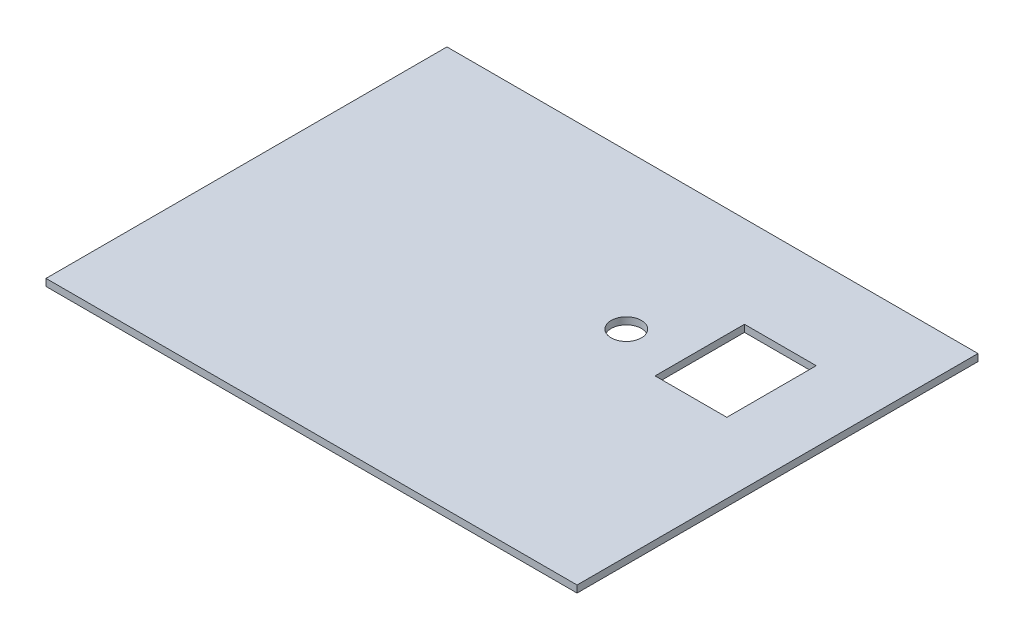
ISO-10303-21;
HEADER;
FILE_DESCRIPTION(('STEP AP214'),'2;1');
FILE_NAME('part.step','',(''),(''),'','','');
FILE_SCHEMA(('AUTOMOTIVE_DESIGN { 1 0 10303 214 1 1 1 1 }'));
ENDSEC;
DATA;
#1=APPLICATION_CONTEXT('core data for automotive mechanical design processes');
#2=APPLICATION_PROTOCOL_DEFINITION('international standard','automotive_design',2000,#1);
#3=PRODUCT_CONTEXT('',#1,'mechanical');
#4=PRODUCT('Part','Part','',(#3));
#5=PRODUCT_RELATED_PRODUCT_CATEGORY('part','',(#4));
#6=PRODUCT_DEFINITION_FORMATION('','',#4);
#7=PRODUCT_DEFINITION_CONTEXT('part definition',#1,'design');
#8=PRODUCT_DEFINITION('design','',#6,#7);
#9=PRODUCT_DEFINITION_SHAPE('','',#8);
#10=(LENGTH_UNIT() NAMED_UNIT(*) SI_UNIT(.MILLI.,.METRE.));
#11=(NAMED_UNIT(*) PLANE_ANGLE_UNIT() SI_UNIT($,.RADIAN.));
#12=(NAMED_UNIT(*) SI_UNIT($,.STERADIAN.) SOLID_ANGLE_UNIT());
#13=UNCERTAINTY_MEASURE_WITH_UNIT(LENGTH_MEASURE(1.E-05),#10,'distance_accuracy_value','');
#14=(GEOMETRIC_REPRESENTATION_CONTEXT(3) GLOBAL_UNCERTAINTY_ASSIGNED_CONTEXT((#13)) GLOBAL_UNIT_ASSIGNED_CONTEXT((#10,
#11,#12)) REPRESENTATION_CONTEXT('',''));
#15=CARTESIAN_POINT('',(0.,0.,0.));
#16=DIRECTION('',(0.,0.,1.));
#17=DIRECTION('',(1.,0.,0.));
#18=AXIS2_PLACEMENT_3D('',#15,#16,#17);
#19=CARTESIAN_POINT('',(0.,2.54,0.));
#20=DIRECTION('',(0.,-1.,0.));
#21=DIRECTION('',(0.,0.,-1.));
#22=AXIS2_PLACEMENT_3D('',#19,#20,#21);
#23=PLANE('',#22);
#24=DIRECTION('',(0.,0.,1.));
#25=VECTOR('',#24,1.);
#26=CARTESIAN_POINT('',(0.,2.54,0.));
#27=LINE('',#26,#25);
#28=CARTESIAN_POINT('',(0.,2.54,-144.78));
#29=VERTEX_POINT('',#28);
#30=CARTESIAN_POINT('',(0.,2.54,0.));
#31=VERTEX_POINT('',#30);
#32=EDGE_CURVE('E156',#29,#31,#27,.T.);
#33=ORIENTED_EDGE('',*,*,#32,.T.);
#34=DIRECTION('',(1.,0.,0.));
#35=VECTOR('',#34,1.);
#36=CARTESIAN_POINT('',(0.,2.54,0.));
#37=LINE('',#36,#35);
#38=CARTESIAN_POINT('',(191.77,2.54,0.));
#39=VERTEX_POINT('',#38);
#40=EDGE_CURVE('E160',#31,#39,#37,.T.);
#41=ORIENTED_EDGE('',*,*,#40,.T.);
#42=DIRECTION('',(0.,0.,-1.));
#43=VECTOR('',#42,1.);
#44=CARTESIAN_POINT('',(191.77,2.54,0.));
#45=LINE('',#44,#43);
#46=CARTESIAN_POINT('',(191.77,2.54,-144.78));
#47=VERTEX_POINT('',#46);
#48=EDGE_CURVE('E164',#39,#47,#45,.T.);
#49=ORIENTED_EDGE('',*,*,#48,.T.);
#50=DIRECTION('',(-1.,0.,0.));
#51=VECTOR('',#50,1.);
#52=CARTESIAN_POINT('',(0.,2.54,-144.78));
#53=LINE('',#52,#51);
#54=EDGE_CURVE('E167',#47,#29,#53,.T.);
#55=ORIENTED_EDGE('',*,*,#54,.T.);
#56=EDGE_LOOP('',(#33,#41,#49,#55));
#57=FACE_BOUND('',#56,.T.);
#58=DIRECTION('',(0.,0.,-1.));
#59=VECTOR('',#58,1.);
#60=CARTESIAN_POINT('',(166.37,2.54,-111.76));
#61=LINE('',#60,#59);
#62=CARTESIAN_POINT('',(166.37,2.54,-79.4766));
#63=VERTEX_POINT('',#62);
#64=CARTESIAN_POINT('',(166.37,2.54,-111.76));
#65=VERTEX_POINT('',#64);
#66=EDGE_CURVE('E105',#63,#65,#61,.T.);
#67=ORIENTED_EDGE('',*,*,#66,.F.);
#68=DIRECTION('',(1.,0.,0.));
#69=VECTOR('',#68,1.);
#70=CARTESIAN_POINT('',(166.37,2.54,-79.4766));
#71=LINE('',#70,#69);
#72=CARTESIAN_POINT('',(140.462,2.54,-79.4766));
#73=VERTEX_POINT('',#72);
#74=EDGE_CURVE('E132',#73,#63,#71,.T.);
#75=ORIENTED_EDGE('',*,*,#74,.F.);
#76=DIRECTION('',(0.,0.,1.));
#77=VECTOR('',#76,1.);
#78=CARTESIAN_POINT('',(140.462,2.54,-111.76));
#79=LINE('',#78,#77);
#80=CARTESIAN_POINT('',(140.462,2.54,-111.76));
#81=VERTEX_POINT('',#80);
#82=EDGE_CURVE('E128',#81,#73,#79,.T.);
#83=ORIENTED_EDGE('',*,*,#82,.F.);
#84=DIRECTION('',(-1.,0.,0.));
#85=VECTOR('',#84,1.);
#86=CARTESIAN_POINT('',(166.37,2.54,-111.76));
#87=LINE('',#86,#85);
#88=EDGE_CURVE('E114',#65,#81,#87,.T.);
#89=ORIENTED_EDGE('',*,*,#88,.F.);
#90=EDGE_LOOP('',(#67,#75,#83,#89));
#91=FACE_BOUND('',#90,.T.);
#92=CARTESIAN_POINT('',(120.65,2.54,-88.9));
#93=DIRECTION('',(0.,1.,0.));
#94=DIRECTION('',(0.,0.,1.));
#95=AXIS2_PLACEMENT_3D('',#92,#93,#94);
#96=CIRCLE('',#95,5.461);
#97=CARTESIAN_POINT('',(120.65,2.54,-83.439));
#98=VERTEX_POINT('',#97);
#99=EDGE_CURVE('E140',#98,#98,#96,.T.);
#100=ORIENTED_EDGE('',*,*,#99,.F.);
#101=EDGE_LOOP('',(#100));
#102=FACE_BOUND('',#101,.T.);
#103=ADVANCED_FACE('F39',(#57,#91,#102),#23,.F.);
#104=CARTESIAN_POINT('',(0.,0.,0.));
#105=DIRECTION('',(0.,-1.,0.));
#106=DIRECTION('',(0.,0.,-1.));
#107=AXIS2_PLACEMENT_3D('',#104,#105,#106);
#108=PLANE('',#107);
#109=DIRECTION('',(1.,0.,0.));
#110=VECTOR('',#109,1.);
#111=CARTESIAN_POINT('',(166.37,0.,-79.4766));
#112=LINE('',#111,#110);
#113=CARTESIAN_POINT('',(140.462,0.,-79.4766));
#114=VERTEX_POINT('',#113);
#115=CARTESIAN_POINT('',(166.37,0.,-79.4766));
#116=VERTEX_POINT('',#115);
#117=EDGE_CURVE('E115',#114,#116,#112,.T.);
#118=ORIENTED_EDGE('',*,*,#117,.T.);
#119=DIRECTION('',(0.,0.,-1.));
#120=VECTOR('',#119,1.);
#121=CARTESIAN_POINT('',(166.37,0.,-111.76));
#122=LINE('',#121,#120);
#123=CARTESIAN_POINT('',(166.37,0.,-111.76));
#124=VERTEX_POINT('',#123);
#125=EDGE_CURVE('E63',#116,#124,#122,.T.);
#126=ORIENTED_EDGE('',*,*,#125,.T.);
#127=DIRECTION('',(-1.,0.,0.));
#128=VECTOR('',#127,1.);
#129=CARTESIAN_POINT('',(166.37,0.,-111.76));
#130=LINE('',#129,#128);
#131=CARTESIAN_POINT('',(140.462,0.,-111.76));
#132=VERTEX_POINT('',#131);
#133=EDGE_CURVE('E121',#124,#132,#130,.T.);
#134=ORIENTED_EDGE('',*,*,#133,.T.);
#135=DIRECTION('',(0.,0.,1.));
#136=VECTOR('',#135,1.);
#137=CARTESIAN_POINT('',(140.462,0.,-111.76));
#138=LINE('',#137,#136);
#139=EDGE_CURVE('E143',#132,#114,#138,.T.);
#140=ORIENTED_EDGE('',*,*,#139,.T.);
#141=EDGE_LOOP('',(#118,#126,#134,#140));
#142=FACE_BOUND('',#141,.T.);
#143=DIRECTION('',(0.,0.,1.));
#144=VECTOR('',#143,1.);
#145=CARTESIAN_POINT('',(0.,0.,0.));
#146=LINE('',#145,#144);
#147=CARTESIAN_POINT('',(0.,0.,-144.78));
#148=VERTEX_POINT('',#147);
#149=CARTESIAN_POINT('',(0.,0.,0.));
#150=VERTEX_POINT('',#149);
#151=EDGE_CURVE('E123',#148,#150,#146,.T.);
#152=ORIENTED_EDGE('',*,*,#151,.F.);
#153=DIRECTION('',(-1.,0.,0.));
#154=VECTOR('',#153,1.);
#155=CARTESIAN_POINT('',(0.,0.,-144.78));
#156=LINE('',#155,#154);
#157=CARTESIAN_POINT('',(191.77,0.,-144.78));
#158=VERTEX_POINT('',#157);
#159=EDGE_CURVE('E161',#158,#148,#156,.T.);
#160=ORIENTED_EDGE('',*,*,#159,.F.);
#161=DIRECTION('',(0.,0.,-1.));
#162=VECTOR('',#161,1.);
#163=CARTESIAN_POINT('',(191.77,0.,0.));
#164=LINE('',#163,#162);
#165=CARTESIAN_POINT('',(191.77,0.,0.));
#166=VERTEX_POINT('',#165);
#167=EDGE_CURVE('E177',#166,#158,#164,.T.);
#168=ORIENTED_EDGE('',*,*,#167,.F.);
#169=DIRECTION('',(1.,0.,0.));
#170=VECTOR('',#169,1.);
#171=CARTESIAN_POINT('',(0.,0.,0.));
#172=LINE('',#171,#170);
#173=EDGE_CURVE('E174',#150,#166,#172,.T.);
#174=ORIENTED_EDGE('',*,*,#173,.F.);
#175=EDGE_LOOP('',(#152,#160,#168,#174));
#176=FACE_BOUND('',#175,.T.);
#177=CARTESIAN_POINT('',(120.65,0.,-88.9));
#178=DIRECTION('',(0.,1.,0.));
#179=DIRECTION('',(0.,0.,1.));
#180=AXIS2_PLACEMENT_3D('',#177,#178,#179);
#181=CIRCLE('',#180,5.461);
#182=CARTESIAN_POINT('',(120.65,0.,-83.439));
#183=VERTEX_POINT('',#182);
#184=EDGE_CURVE('E254',#183,#183,#181,.T.);
#185=ORIENTED_EDGE('',*,*,#184,.T.);
#186=EDGE_LOOP('',(#185));
#187=FACE_BOUND('',#186,.T.);
#188=ADVANCED_FACE('F200',(#142,#176,#187),#108,.T.);
#189=CARTESIAN_POINT('',(0.,2.54,0.));
#190=DIRECTION('',(1.,0.,0.));
#191=DIRECTION('',(0.,0.,-1.));
#192=AXIS2_PLACEMENT_3D('',#189,#190,#191);
#193=PLANE('',#192);
#194=ORIENTED_EDGE('',*,*,#151,.T.);
#195=DIRECTION('',(0.,-1.,0.));
#196=VECTOR('',#195,1.);
#197=CARTESIAN_POINT('',(0.,2.54,0.));
#198=LINE('',#197,#196);
#199=EDGE_CURVE('E11',#31,#150,#198,.T.);
#200=ORIENTED_EDGE('',*,*,#199,.F.);
#201=ORIENTED_EDGE('',*,*,#32,.F.);
#202=DIRECTION('',(0.,-1.,0.));
#203=VECTOR('',#202,1.);
#204=CARTESIAN_POINT('',(0.,2.54,-144.78));
#205=LINE('',#204,#203);
#206=EDGE_CURVE('E170',#29,#148,#205,.T.);
#207=ORIENTED_EDGE('',*,*,#206,.T.);
#208=EDGE_LOOP('',(#194,#200,#201,#207));
#209=FACE_BOUND('',#208,.T.);
#210=ADVANCED_FACE('F41',(#209),#193,.F.);
#211=CARTESIAN_POINT('',(0.,2.54,0.));
#212=DIRECTION('',(0.,0.,-1.));
#213=DIRECTION('',(-1.,0.,0.));
#214=AXIS2_PLACEMENT_3D('',#211,#212,#213);
#215=PLANE('',#214);
#216=ORIENTED_EDGE('',*,*,#173,.T.);
#217=DIRECTION('',(0.,-1.,0.));
#218=VECTOR('',#217,1.);
#219=CARTESIAN_POINT('',(191.77,2.54,0.));
#220=LINE('',#219,#218);
#221=EDGE_CURVE('E48',#39,#166,#220,.T.);
#222=ORIENTED_EDGE('',*,*,#221,.F.);
#223=ORIENTED_EDGE('',*,*,#40,.F.);
#224=ORIENTED_EDGE('',*,*,#199,.T.);
#225=EDGE_LOOP('',(#216,#222,#223,#224));
#226=FACE_BOUND('',#225,.T.);
#227=ADVANCED_FACE('F210',(#226),#215,.F.);
#228=CARTESIAN_POINT('',(191.77,2.54,0.));
#229=DIRECTION('',(-1.,0.,0.));
#230=DIRECTION('',(0.,0.,1.));
#231=AXIS2_PLACEMENT_3D('',#228,#229,#230);
#232=PLANE('',#231);
#233=ORIENTED_EDGE('',*,*,#167,.T.);
#234=DIRECTION('',(0.,-1.,0.));
#235=VECTOR('',#234,1.);
#236=CARTESIAN_POINT('',(191.77,2.54,-144.78));
#237=LINE('',#236,#235);
#238=EDGE_CURVE('E185',#47,#158,#237,.T.);
#239=ORIENTED_EDGE('',*,*,#238,.F.);
#240=ORIENTED_EDGE('',*,*,#48,.F.);
#241=ORIENTED_EDGE('',*,*,#221,.T.);
#242=EDGE_LOOP('',(#233,#239,#240,#241));
#243=FACE_BOUND('',#242,.T.);
#244=ADVANCED_FACE('F194',(#243),#232,.F.);
#245=CARTESIAN_POINT('',(0.,2.54,-144.78));
#246=DIRECTION('',(0.,0.,1.));
#247=DIRECTION('',(1.,0.,0.));
#248=AXIS2_PLACEMENT_3D('',#245,#246,#247);
#249=PLANE('',#248);
#250=ORIENTED_EDGE('',*,*,#159,.T.);
#251=ORIENTED_EDGE('',*,*,#206,.F.);
#252=ORIENTED_EDGE('',*,*,#54,.F.);
#253=ORIENTED_EDGE('',*,*,#238,.T.);
#254=EDGE_LOOP('',(#250,#251,#252,#253));
#255=FACE_BOUND('',#254,.T.);
#256=ADVANCED_FACE('F204',(#255),#249,.F.);
#257=CARTESIAN_POINT('',(166.37,2.54,-111.76));
#258=DIRECTION('',(-1.,0.,0.));
#259=DIRECTION('',(0.,0.,1.));
#260=AXIS2_PLACEMENT_3D('',#257,#258,#259);
#261=PLANE('',#260);
#262=ORIENTED_EDGE('',*,*,#125,.F.);
#263=DIRECTION('',(0.,-1.,0.));
#264=VECTOR('',#263,1.);
#265=CARTESIAN_POINT('',(166.37,2.54,-79.4766));
#266=LINE('',#265,#264);
#267=EDGE_CURVE('E109',#63,#116,#266,.T.);
#268=ORIENTED_EDGE('',*,*,#267,.F.);
#269=ORIENTED_EDGE('',*,*,#66,.T.);
#270=DIRECTION('',(0.,-1.,0.));
#271=VECTOR('',#270,1.);
#272=CARTESIAN_POINT('',(166.37,2.54,-111.76));
#273=LINE('',#272,#271);
#274=EDGE_CURVE('E108',#65,#124,#273,.T.);
#275=ORIENTED_EDGE('',*,*,#274,.T.);
#276=EDGE_LOOP('',(#262,#268,#269,#275));
#277=FACE_BOUND('',#276,.T.);
#278=ADVANCED_FACE('F107',(#277),#261,.T.);
#279=CARTESIAN_POINT('',(166.37,2.54,-111.76));
#280=DIRECTION('',(0.,0.,1.));
#281=DIRECTION('',(1.,0.,0.));
#282=AXIS2_PLACEMENT_3D('',#279,#280,#281);
#283=PLANE('',#282);
#284=ORIENTED_EDGE('',*,*,#133,.F.);
#285=ORIENTED_EDGE('',*,*,#274,.F.);
#286=ORIENTED_EDGE('',*,*,#88,.T.);
#287=DIRECTION('',(0.,-1.,0.));
#288=VECTOR('',#287,1.);
#289=CARTESIAN_POINT('',(140.462,2.54,-111.76));
#290=LINE('',#289,#288);
#291=EDGE_CURVE('E124',#81,#132,#290,.T.);
#292=ORIENTED_EDGE('',*,*,#291,.T.);
#293=EDGE_LOOP('',(#284,#285,#286,#292));
#294=FACE_BOUND('',#293,.T.);
#295=ADVANCED_FACE('F118',(#294),#283,.T.);
#296=CARTESIAN_POINT('',(140.462,2.54,-111.76));
#297=DIRECTION('',(1.,0.,0.));
#298=DIRECTION('',(0.,0.,-1.));
#299=AXIS2_PLACEMENT_3D('',#296,#297,#298);
#300=PLANE('',#299);
#301=ORIENTED_EDGE('',*,*,#139,.F.);
#302=ORIENTED_EDGE('',*,*,#291,.F.);
#303=ORIENTED_EDGE('',*,*,#82,.T.);
#304=DIRECTION('',(0.,-1.,0.));
#305=VECTOR('',#304,1.);
#306=CARTESIAN_POINT('',(140.462,2.54,-79.4766));
#307=LINE('',#306,#305);
#308=EDGE_CURVE('E55',#73,#114,#307,.T.);
#309=ORIENTED_EDGE('',*,*,#308,.T.);
#310=EDGE_LOOP('',(#301,#302,#303,#309));
#311=FACE_BOUND('',#310,.T.);
#312=ADVANCED_FACE('F234',(#311),#300,.T.);
#313=CARTESIAN_POINT('',(166.37,2.54,-79.4766));
#314=DIRECTION('',(0.,0.,-1.));
#315=DIRECTION('',(-1.,0.,0.));
#316=AXIS2_PLACEMENT_3D('',#313,#314,#315);
#317=PLANE('',#316);
#318=ORIENTED_EDGE('',*,*,#117,.F.);
#319=ORIENTED_EDGE('',*,*,#308,.F.);
#320=ORIENTED_EDGE('',*,*,#74,.T.);
#321=ORIENTED_EDGE('',*,*,#267,.T.);
#322=EDGE_LOOP('',(#318,#319,#320,#321));
#323=FACE_BOUND('',#322,.T.);
#324=ADVANCED_FACE('F238',(#323),#317,.T.);
#325=CARTESIAN_POINT('',(120.65,2.54,-88.9));
#326=DIRECTION('',(0.,-1.,0.));
#327=DIRECTION('',(0.,0.,-1.));
#328=AXIS2_PLACEMENT_3D('',#325,#326,#327);
#329=CYLINDRICAL_SURFACE('',#328,5.461);
#330=ORIENTED_EDGE('',*,*,#99,.T.);
#331=EDGE_LOOP('',(#330));
#332=FACE_BOUND('',#331,.T.);
#333=ORIENTED_EDGE('',*,*,#184,.F.);
#334=EDGE_LOOP('',(#333));
#335=FACE_BOUND('',#334,.T.);
#336=ADVANCED_FACE('F244',(#332,#335),#329,.F.);
#337=CLOSED_SHELL('',(#103,#188,#210,#227,#244,#256,#278,#295,#312,#324,#336));
#338=MANIFOLD_SOLID_BREP('B2',#337);
#339=ADVANCED_BREP_SHAPE_REPRESENTATION('',(#18,#338),#14);
#340=SHAPE_DEFINITION_REPRESENTATION(#9,#339);
ENDSEC;
END-ISO-10303-21;
